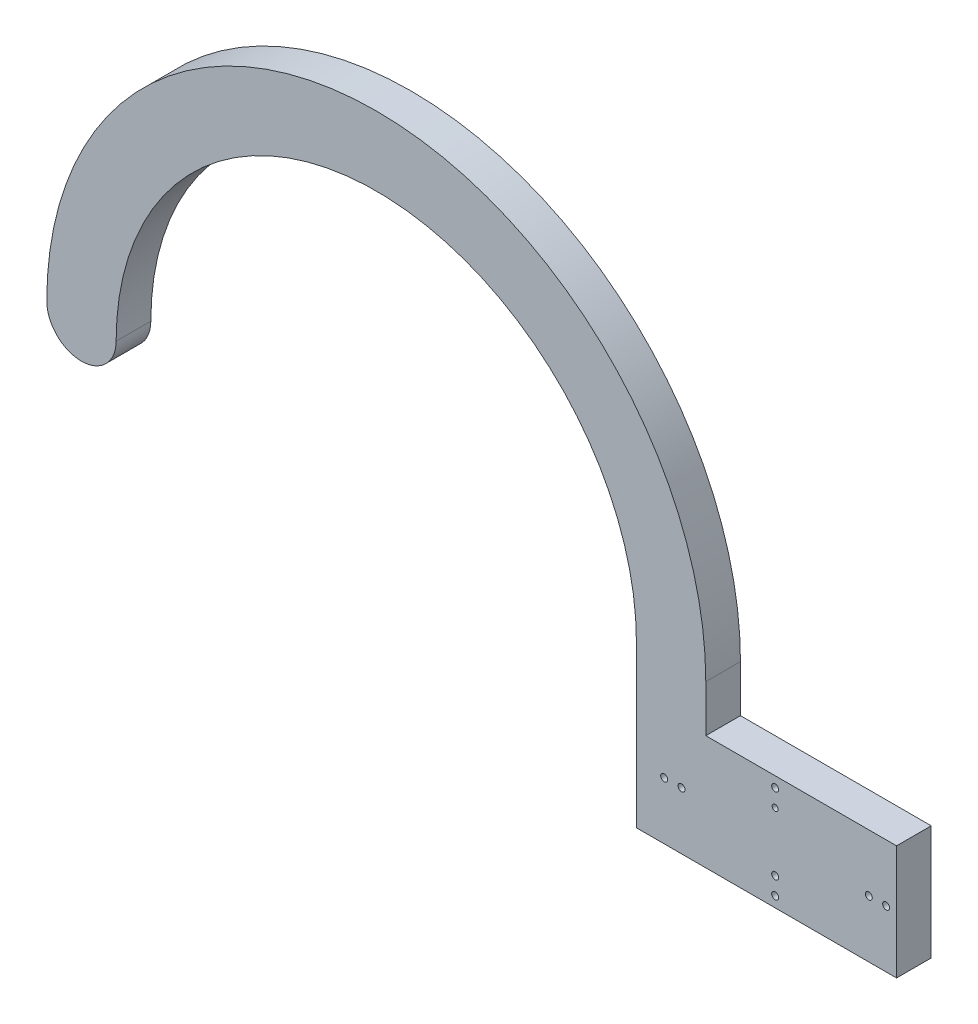
ISO-10303-21;
HEADER;
FILE_DESCRIPTION(('STEP AP214'),'2;1');
FILE_NAME('part.step','',(''),(''),'','','');
FILE_SCHEMA(('AUTOMOTIVE_DESIGN { 1 0 10303 214 1 1 1 1 }'));
ENDSEC;
DATA;
#1=APPLICATION_CONTEXT('core data for automotive mechanical design processes');
#2=APPLICATION_PROTOCOL_DEFINITION('international standard','automotive_design',2000,#1);
#3=PRODUCT_CONTEXT('',#1,'mechanical');
#4=PRODUCT('Part','Part','',(#3));
#5=PRODUCT_RELATED_PRODUCT_CATEGORY('part','',(#4));
#6=PRODUCT_DEFINITION_FORMATION('','',#4);
#7=PRODUCT_DEFINITION_CONTEXT('part definition',#1,'design');
#8=PRODUCT_DEFINITION('design','',#6,#7);
#9=PRODUCT_DEFINITION_SHAPE('','',#8);
#10=(LENGTH_UNIT() NAMED_UNIT(*) SI_UNIT(.MILLI.,.METRE.));
#11=(NAMED_UNIT(*) PLANE_ANGLE_UNIT() SI_UNIT($,.RADIAN.));
#12=(NAMED_UNIT(*) SI_UNIT($,.STERADIAN.) SOLID_ANGLE_UNIT());
#13=UNCERTAINTY_MEASURE_WITH_UNIT(LENGTH_MEASURE(1.E-05),#10,'distance_accuracy_value','');
#14=(GEOMETRIC_REPRESENTATION_CONTEXT(3) GLOBAL_UNCERTAINTY_ASSIGNED_CONTEXT((#13)) GLOBAL_UNIT_ASSIGNED_CONTEXT((#10,
#11,#12)) REPRESENTATION_CONTEXT('',''));
#15=CARTESIAN_POINT('',(0.,0.,0.));
#16=DIRECTION('',(0.,0.,1.));
#17=DIRECTION('',(1.,0.,0.));
#18=AXIS2_PLACEMENT_3D('',#15,#16,#17);
#19=CARTESIAN_POINT('',(37.5,9.80681495363282E-13,5.));
#20=DIRECTION('',(0.,0.,-1.));
#21=DIRECTION('',(-1.,0.,0.));
#22=AXIS2_PLACEMENT_3D('',#19,#20,#21);
#23=CYLINDRICAL_SURFACE('',#22,37.5);
#24=CARTESIAN_POINT('',(37.5,9.80681495363282E-13,0.));
#25=DIRECTION('',(0.,0.,1.));
#26=DIRECTION('',(1.,0.,0.));
#27=AXIS2_PLACEMENT_3D('',#24,#25,#26);
#28=CIRCLE('',#27,37.5);
#29=CARTESIAN_POINT('',(0.,0.,0.));
#30=VERTEX_POINT('',#29);
#31=CARTESIAN_POINT('',(75.,9.80987654294656E-13,0.));
#32=VERTEX_POINT('',#31);
#33=EDGE_CURVE('E155',#30,#32,#28,.F.);
#34=ORIENTED_EDGE('',*,*,#33,.T.);
#35=DIRECTION('',(0.,0.,-1.));
#36=VECTOR('',#35,1.);
#37=CARTESIAN_POINT('',(75.,9.80987654294656E-13,5.));
#38=LINE('',#37,#36);
#39=CARTESIAN_POINT('',(75.,9.80987654294656E-13,5.));
#40=VERTEX_POINT('',#39);
#41=EDGE_CURVE('E11',#40,#32,#38,.T.);
#42=ORIENTED_EDGE('',*,*,#41,.F.);
#43=CARTESIAN_POINT('',(37.5,9.80681495363282E-13,5.));
#44=DIRECTION('',(0.,0.,1.));
#45=DIRECTION('',(1.,0.,0.));
#46=AXIS2_PLACEMENT_3D('',#43,#44,#45);
#47=CIRCLE('',#46,37.5);
#48=CARTESIAN_POINT('',(0.,0.,5.));
#49=VERTEX_POINT('',#48);
#50=EDGE_CURVE('E225',#49,#40,#47,.F.);
#51=ORIENTED_EDGE('',*,*,#50,.F.);
#52=DIRECTION('',(0.,0.,-1.));
#53=VECTOR('',#52,1.);
#54=CARTESIAN_POINT('',(0.,0.,5.));
#55=LINE('',#54,#53);
#56=EDGE_CURVE('E151',#49,#30,#55,.T.);
#57=ORIENTED_EDGE('',*,*,#56,.T.);
#58=EDGE_LOOP('',(#34,#42,#51,#57));
#59=FACE_BOUND('',#58,.T.);
#60=ADVANCED_FACE('F35',(#59),#23,.F.);
#61=CARTESIAN_POINT('',(75.,0.,5.));
#62=DIRECTION('',(1.,0.,0.));
#63=DIRECTION('',(0.,0.,-1.));
#64=AXIS2_PLACEMENT_3D('',#61,#62,#63);
#65=PLANE('',#64);
#66=DIRECTION('',(0.,-1.,0.));
#67=VECTOR('',#66,1.);
#68=CARTESIAN_POINT('',(75.,0.,0.));
#69=LINE('',#68,#67);
#70=CARTESIAN_POINT('',(75.,-23.2499999999994,0.));
#71=VERTEX_POINT('',#70);
#72=EDGE_CURVE('E158',#32,#71,#69,.T.);
#73=ORIENTED_EDGE('',*,*,#72,.T.);
#74=DIRECTION('',(0.,0.,-1.));
#75=VECTOR('',#74,1.);
#76=CARTESIAN_POINT('',(75.,-23.2499999999994,5.));
#77=LINE('',#76,#75);
#78=CARTESIAN_POINT('',(75.,-23.2499999999994,5.));
#79=VERTEX_POINT('',#78);
#80=EDGE_CURVE('E44',#79,#71,#77,.T.);
#81=ORIENTED_EDGE('',*,*,#80,.F.);
#82=DIRECTION('',(0.,-1.,0.));
#83=VECTOR('',#82,1.);
#84=CARTESIAN_POINT('',(75.,0.,5.));
#85=LINE('',#84,#83);
#86=EDGE_CURVE('E91',#40,#79,#85,.T.);
#87=ORIENTED_EDGE('',*,*,#86,.F.);
#88=ORIENTED_EDGE('',*,*,#41,.T.);
#89=EDGE_LOOP('',(#73,#81,#87,#88));
#90=FACE_BOUND('',#89,.T.);
#91=ADVANCED_FACE('F244',(#90),#65,.F.);
#92=CARTESIAN_POINT('',(0.,-23.2499999999993,5.));
#93=DIRECTION('',(0.,1.,0.));
#94=DIRECTION('',(-1.,0.,0.));
#95=AXIS2_PLACEMENT_3D('',#92,#93,#94);
#96=PLANE('',#95);
#97=DIRECTION('',(1.,0.,0.));
#98=VECTOR('',#97,1.);
#99=CARTESIAN_POINT('',(0.,-23.2499999999993,0.));
#100=LINE('',#99,#98);
#101=CARTESIAN_POINT('',(112.50018609535,-23.2499999999994,0.));
#102=VERTEX_POINT('',#101);
#103=EDGE_CURVE('E160',#71,#102,#100,.T.);
#104=ORIENTED_EDGE('',*,*,#103,.T.);
#105=DIRECTION('',(0.,0.,-1.));
#106=VECTOR('',#105,1.);
#107=CARTESIAN_POINT('',(112.50018609535,-23.2499999999994,5.));
#108=LINE('',#107,#106);
#109=CARTESIAN_POINT('',(112.50018609535,-23.2499999999994,5.));
#110=VERTEX_POINT('',#109);
#111=EDGE_CURVE('E199',#110,#102,#108,.T.);
#112=ORIENTED_EDGE('',*,*,#111,.F.);
#113=DIRECTION('',(1.,0.,0.));
#114=VECTOR('',#113,1.);
#115=CARTESIAN_POINT('',(0.,-23.2499999999993,5.));
#116=LINE('',#115,#114);
#117=EDGE_CURVE('E207',#79,#110,#116,.T.);
#118=ORIENTED_EDGE('',*,*,#117,.F.);
#119=ORIENTED_EDGE('',*,*,#80,.T.);
#120=EDGE_LOOP('',(#104,#112,#118,#119));
#121=FACE_BOUND('',#120,.T.);
#122=ADVANCED_FACE('F205',(#121),#96,.F.);
#123=CARTESIAN_POINT('',(112.50018609535,0.,5.));
#124=DIRECTION('',(-1.,0.,0.));
#125=DIRECTION('',(0.,0.,1.));
#126=AXIS2_PLACEMENT_3D('',#123,#124,#125);
#127=PLANE('',#126);
#128=DIRECTION('',(0.,1.,0.));
#129=VECTOR('',#128,1.);
#130=CARTESIAN_POINT('',(112.50018609535,0.,0.));
#131=LINE('',#130,#129);
#132=CARTESIAN_POINT('',(112.50018609535,-6.74999999999938,0.));
#133=VERTEX_POINT('',#132);
#134=EDGE_CURVE('E162',#102,#133,#131,.T.);
#135=ORIENTED_EDGE('',*,*,#134,.T.);
#136=DIRECTION('',(0.,0.,-1.));
#137=VECTOR('',#136,1.);
#138=CARTESIAN_POINT('',(112.50018609535,-6.74999999999938,5.));
#139=LINE('',#138,#137);
#140=CARTESIAN_POINT('',(112.50018609535,-6.74999999999938,5.));
#141=VERTEX_POINT('',#140);
#142=EDGE_CURVE('E196',#141,#133,#139,.T.);
#143=ORIENTED_EDGE('',*,*,#142,.F.);
#144=DIRECTION('',(0.,1.,0.));
#145=VECTOR('',#144,1.);
#146=CARTESIAN_POINT('',(112.50018609535,0.,5.));
#147=LINE('',#146,#145);
#148=EDGE_CURVE('E220',#110,#141,#147,.T.);
#149=ORIENTED_EDGE('',*,*,#148,.F.);
#150=ORIENTED_EDGE('',*,*,#111,.T.);
#151=EDGE_LOOP('',(#135,#143,#149,#150));
#152=FACE_BOUND('',#151,.T.);
#153=ADVANCED_FACE('F216',(#152),#127,.F.);
#154=CARTESIAN_POINT('',(0.,-6.74999999999939,5.));
#155=DIRECTION('',(0.,-1.,0.));
#156=DIRECTION('',(1.,0.,0.));
#157=AXIS2_PLACEMENT_3D('',#154,#155,#156);
#158=PLANE('',#157);
#159=DIRECTION('',(-1.,0.,0.));
#160=VECTOR('',#159,1.);
#161=CARTESIAN_POINT('',(0.,-6.74999999999939,0.));
#162=LINE('',#161,#160);
#163=CARTESIAN_POINT('',(85.,-6.74999999999938,0.));
#164=VERTEX_POINT('',#163);
#165=EDGE_CURVE('E164',#133,#164,#162,.T.);
#166=ORIENTED_EDGE('',*,*,#165,.T.);
#167=DIRECTION('',(0.,0.,-1.));
#168=VECTOR('',#167,1.);
#169=CARTESIAN_POINT('',(85.,-6.74999999999938,5.));
#170=LINE('',#169,#168);
#171=CARTESIAN_POINT('',(85.,-6.74999999999938,5.));
#172=VERTEX_POINT('',#171);
#173=EDGE_CURVE('E116',#172,#164,#170,.T.);
#174=ORIENTED_EDGE('',*,*,#173,.F.);
#175=DIRECTION('',(-1.,0.,0.));
#176=VECTOR('',#175,1.);
#177=CARTESIAN_POINT('',(0.,-6.74999999999939,5.));
#178=LINE('',#177,#176);
#179=EDGE_CURVE('E122',#141,#172,#178,.T.);
#180=ORIENTED_EDGE('',*,*,#179,.F.);
#181=ORIENTED_EDGE('',*,*,#142,.T.);
#182=EDGE_LOOP('',(#166,#174,#180,#181));
#183=FACE_BOUND('',#182,.T.);
#184=ADVANCED_FACE('F219',(#183),#158,.F.);
#185=CARTESIAN_POINT('',(85.,0.,5.));
#186=DIRECTION('',(1.,0.,0.));
#187=DIRECTION('',(0.,0.,-1.));
#188=AXIS2_PLACEMENT_3D('',#185,#186,#187);
#189=PLANE('',#188);
#190=DIRECTION('',(0.,-1.,0.));
#191=VECTOR('',#190,1.);
#192=CARTESIAN_POINT('',(85.,0.,0.));
#193=LINE('',#192,#191);
#194=CARTESIAN_POINT('',(85.,6.8668567957679E-13,0.));
#195=VERTEX_POINT('',#194);
#196=EDGE_CURVE('E111',#195,#164,#193,.T.);
#197=ORIENTED_EDGE('',*,*,#196,.F.);
#198=DIRECTION('',(0.,0.,-1.));
#199=VECTOR('',#198,1.);
#200=CARTESIAN_POINT('',(85.,6.8668567957679E-13,5.));
#201=LINE('',#200,#199);
#202=CARTESIAN_POINT('',(85.,6.8668567957679E-13,5.));
#203=VERTEX_POINT('',#202);
#204=EDGE_CURVE('E106',#203,#195,#201,.T.);
#205=ORIENTED_EDGE('',*,*,#204,.F.);
#206=DIRECTION('',(0.,-1.,0.));
#207=VECTOR('',#206,1.);
#208=CARTESIAN_POINT('',(85.,0.,5.));
#209=LINE('',#208,#207);
#210=EDGE_CURVE('E109',#203,#172,#209,.T.);
#211=ORIENTED_EDGE('',*,*,#210,.T.);
#212=ORIENTED_EDGE('',*,*,#173,.T.);
#213=EDGE_LOOP('',(#197,#205,#211,#212));
#214=FACE_BOUND('',#213,.T.);
#215=ADVANCED_FACE('F108',(#214),#189,.T.);
#216=CARTESIAN_POINT('',(37.5,0.,5.));
#217=DIRECTION('',(0.,0.,-1.));
#218=DIRECTION('',(-1.,0.,0.));
#219=AXIS2_PLACEMENT_3D('',#216,#217,#218);
#220=CYLINDRICAL_SURFACE('',#219,47.5);
#221=CARTESIAN_POINT('',(37.5,0.,0.));
#222=DIRECTION('',(0.,0.,1.));
#223=DIRECTION('',(1.,0.,0.));
#224=AXIS2_PLACEMENT_3D('',#221,#222,#223);
#225=CIRCLE('',#224,47.5);
#226=CARTESIAN_POINT('',(-10.,-1.39453308442576E-13,0.));
#227=VERTEX_POINT('',#226);
#228=EDGE_CURVE('E168',#227,#195,#225,.F.);
#229=ORIENTED_EDGE('',*,*,#228,.F.);
#230=DIRECTION('',(0.,0.,-1.));
#231=VECTOR('',#230,1.);
#232=CARTESIAN_POINT('',(-10.,-1.39453308442576E-13,5.));
#233=LINE('',#232,#231);
#234=CARTESIAN_POINT('',(-10.,-1.39453308442576E-13,5.));
#235=VERTEX_POINT('',#234);
#236=EDGE_CURVE('E80',#235,#227,#233,.T.);
#237=ORIENTED_EDGE('',*,*,#236,.F.);
#238=CARTESIAN_POINT('',(37.5,0.,5.));
#239=DIRECTION('',(0.,0.,1.));
#240=DIRECTION('',(1.,0.,0.));
#241=AXIS2_PLACEMENT_3D('',#238,#239,#240);
#242=CIRCLE('',#241,47.5);
#243=EDGE_CURVE('E120',#235,#203,#242,.F.);
#244=ORIENTED_EDGE('',*,*,#243,.T.);
#245=ORIENTED_EDGE('',*,*,#204,.T.);
#246=EDGE_LOOP('',(#229,#237,#244,#245));
#247=FACE_BOUND('',#246,.T.);
#248=ADVANCED_FACE('F125',(#247),#220,.T.);
#249=CARTESIAN_POINT('',(95.,-10.7499999999994,5.));
#250=DIRECTION('',(0.,0.,-1.));
#251=DIRECTION('',(-1.,0.,0.));
#252=AXIS2_PLACEMENT_3D('',#249,#250,#251);
#253=CYLINDRICAL_SURFACE('',#252,0.429709328929351);
#254=CARTESIAN_POINT('',(95.,-10.7499999999994,5.));
#255=DIRECTION('',(0.,0.,1.));
#256=DIRECTION('',(1.,0.,0.));
#257=AXIS2_PLACEMENT_3D('',#254,#255,#256);
#258=CIRCLE('',#257,0.429709328929351);
#259=CARTESIAN_POINT('',(95.4297093289294,-10.7499999999994,5.));
#260=VERTEX_POINT('',#259);
#261=EDGE_CURVE('E145',#260,#260,#258,.T.);
#262=ORIENTED_EDGE('',*,*,#261,.T.);
#263=EDGE_LOOP('',(#262));
#264=FACE_BOUND('',#263,.T.);
#265=CARTESIAN_POINT('',(95.,-10.7499999999994,0.));
#266=DIRECTION('',(0.,0.,1.));
#267=DIRECTION('',(1.,0.,0.));
#268=AXIS2_PLACEMENT_3D('',#265,#266,#267);
#269=CIRCLE('',#268,0.429709328929351);
#270=CARTESIAN_POINT('',(95.4297093289294,-10.7499999999994,0.));
#271=VERTEX_POINT('',#270);
#272=EDGE_CURVE('E186',#271,#271,#269,.T.);
#273=ORIENTED_EDGE('',*,*,#272,.F.);
#274=EDGE_LOOP('',(#273));
#275=FACE_BOUND('',#274,.T.);
#276=ADVANCED_FACE('F261',(#264,#275),#253,.F.);
#277=CARTESIAN_POINT('',(95.,-19.2299999999994,5.));
#278=DIRECTION('',(0.,0.,-1.));
#279=DIRECTION('',(-1.,0.,0.));
#280=AXIS2_PLACEMENT_3D('',#277,#278,#279);
#281=CYLINDRICAL_SURFACE('',#280,0.499999999999999);
#282=CARTESIAN_POINT('',(95.,-19.2299999999994,5.));
#283=DIRECTION('',(0.,0.,1.));
#284=DIRECTION('',(1.,0.,0.));
#285=AXIS2_PLACEMENT_3D('',#282,#283,#284);
#286=CIRCLE('',#285,0.499999999999999);
#287=CARTESIAN_POINT('',(95.5,-19.2299999999994,5.));
#288=VERTEX_POINT('',#287);
#289=EDGE_CURVE('E142',#288,#288,#286,.T.);
#290=ORIENTED_EDGE('',*,*,#289,.T.);
#291=EDGE_LOOP('',(#290));
#292=FACE_BOUND('',#291,.T.);
#293=CARTESIAN_POINT('',(95.,-19.2299999999994,0.));
#294=DIRECTION('',(0.,0.,1.));
#295=DIRECTION('',(1.,0.,0.));
#296=AXIS2_PLACEMENT_3D('',#293,#294,#295);
#297=CIRCLE('',#296,0.499999999999999);
#298=CARTESIAN_POINT('',(95.5,-19.2299999999994,0.));
#299=VERTEX_POINT('',#298);
#300=EDGE_CURVE('E183',#299,#299,#297,.T.);
#301=ORIENTED_EDGE('',*,*,#300,.F.);
#302=EDGE_LOOP('',(#301));
#303=FACE_BOUND('',#302,.T.);
#304=ADVANCED_FACE('F280',(#292,#303),#281,.F.);
#305=CARTESIAN_POINT('',(108.50018609535,-14.9999999999994,5.));
#306=DIRECTION('',(0.,0.,-1.));
#307=DIRECTION('',(-1.,0.,0.));
#308=AXIS2_PLACEMENT_3D('',#305,#306,#307);
#309=CYLINDRICAL_SURFACE('',#308,0.499999999999999);
#310=CARTESIAN_POINT('',(108.50018609535,-14.9999999999994,5.));
#311=DIRECTION('',(0.,0.,1.));
#312=DIRECTION('',(1.,0.,0.));
#313=AXIS2_PLACEMENT_3D('',#310,#311,#312);
#314=CIRCLE('',#313,0.499999999999999);
#315=CARTESIAN_POINT('',(109.00018609535,-14.9999999999994,5.));
#316=VERTEX_POINT('',#315);
#317=EDGE_CURVE('E139',#316,#316,#314,.T.);
#318=ORIENTED_EDGE('',*,*,#317,.T.);
#319=EDGE_LOOP('',(#318));
#320=FACE_BOUND('',#319,.T.);
#321=CARTESIAN_POINT('',(108.50018609535,-14.9999999999994,0.));
#322=DIRECTION('',(0.,0.,1.));
#323=DIRECTION('',(1.,0.,0.));
#324=AXIS2_PLACEMENT_3D('',#321,#322,#323);
#325=CIRCLE('',#324,0.499999999999999);
#326=CARTESIAN_POINT('',(109.00018609535,-14.9999999999994,0.));
#327=VERTEX_POINT('',#326);
#328=EDGE_CURVE('E180',#327,#327,#325,.T.);
#329=ORIENTED_EDGE('',*,*,#328,.F.);
#330=EDGE_LOOP('',(#329));
#331=FACE_BOUND('',#330,.T.);
#332=ADVANCED_FACE('F276',(#320,#331),#309,.F.);
#333=CARTESIAN_POINT('',(111.00018609535,-14.9999999999994,5.));
#334=DIRECTION('',(0.,0.,-1.));
#335=DIRECTION('',(-1.,0.,0.));
#336=AXIS2_PLACEMENT_3D('',#333,#334,#335);
#337=CYLINDRICAL_SURFACE('',#336,0.499999999999999);
#338=CARTESIAN_POINT('',(111.00018609535,-14.9999999999994,5.));
#339=DIRECTION('',(0.,0.,1.));
#340=DIRECTION('',(1.,0.,0.));
#341=AXIS2_PLACEMENT_3D('',#338,#339,#340);
#342=CIRCLE('',#341,0.499999999999999);
#343=CARTESIAN_POINT('',(111.50018609535,-14.9999999999994,5.));
#344=VERTEX_POINT('',#343);
#345=EDGE_CURVE('E136',#344,#344,#342,.T.);
#346=ORIENTED_EDGE('',*,*,#345,.T.);
#347=EDGE_LOOP('',(#346));
#348=FACE_BOUND('',#347,.T.);
#349=CARTESIAN_POINT('',(111.00018609535,-14.9999999999994,0.));
#350=DIRECTION('',(0.,0.,1.));
#351=DIRECTION('',(1.,0.,0.));
#352=AXIS2_PLACEMENT_3D('',#349,#350,#351);
#353=CIRCLE('',#352,0.499999999999999);
#354=CARTESIAN_POINT('',(111.50018609535,-14.9999999999994,0.));
#355=VERTEX_POINT('',#354);
#356=EDGE_CURVE('E177',#355,#355,#353,.T.);
#357=ORIENTED_EDGE('',*,*,#356,.F.);
#358=EDGE_LOOP('',(#357));
#359=FACE_BOUND('',#358,.T.);
#360=ADVANCED_FACE('F272',(#348,#359),#337,.F.);
#361=CARTESIAN_POINT('',(95.,-21.7299999999994,5.));
#362=DIRECTION('',(0.,0.,-1.));
#363=DIRECTION('',(-1.,0.,0.));
#364=AXIS2_PLACEMENT_3D('',#361,#362,#363);
#365=CYLINDRICAL_SURFACE('',#364,0.499999999999999);
#366=CARTESIAN_POINT('',(95.,-21.7299999999994,5.));
#367=DIRECTION('',(0.,0.,1.));
#368=DIRECTION('',(1.,0.,0.));
#369=AXIS2_PLACEMENT_3D('',#366,#367,#368);
#370=CIRCLE('',#369,0.499999999999999);
#371=CARTESIAN_POINT('',(95.5,-21.7299999999994,5.));
#372=VERTEX_POINT('',#371);
#373=EDGE_CURVE('E133',#372,#372,#370,.T.);
#374=ORIENTED_EDGE('',*,*,#373,.T.);
#375=EDGE_LOOP('',(#374));
#376=FACE_BOUND('',#375,.T.);
#377=CARTESIAN_POINT('',(95.,-21.7299999999994,0.));
#378=DIRECTION('',(0.,0.,1.));
#379=DIRECTION('',(1.,0.,0.));
#380=AXIS2_PLACEMENT_3D('',#377,#378,#379);
#381=CIRCLE('',#380,0.499999999999999);
#382=CARTESIAN_POINT('',(95.5,-21.7299999999994,0.));
#383=VERTEX_POINT('',#382);
#384=EDGE_CURVE('E174',#383,#383,#381,.T.);
#385=ORIENTED_EDGE('',*,*,#384,.F.);
#386=EDGE_LOOP('',(#385));
#387=FACE_BOUND('',#386,.T.);
#388=ADVANCED_FACE('F268',(#376,#387),#365,.F.);
#389=CARTESIAN_POINT('',(81.5001860953498,-14.9999999999994,5.));
#390=DIRECTION('',(0.,0.,-1.));
#391=DIRECTION('',(-1.,0.,0.));
#392=AXIS2_PLACEMENT_3D('',#389,#390,#391);
#393=CYLINDRICAL_SURFACE('',#392,0.499999999999999);
#394=CARTESIAN_POINT('',(81.5001860953498,-14.9999999999994,5.));
#395=DIRECTION('',(0.,0.,1.));
#396=DIRECTION('',(1.,0.,0.));
#397=AXIS2_PLACEMENT_3D('',#394,#395,#396);
#398=CIRCLE('',#397,0.499999999999999);
#399=CARTESIAN_POINT('',(82.0001860953498,-14.9999999999994,5.));
#400=VERTEX_POINT('',#399);
#401=EDGE_CURVE('E127',#400,#400,#398,.T.);
#402=ORIENTED_EDGE('',*,*,#401,.T.);
#403=EDGE_LOOP('',(#402));
#404=FACE_BOUND('',#403,.T.);
#405=CARTESIAN_POINT('',(81.5001860953498,-14.9999999999994,0.));
#406=DIRECTION('',(0.,0.,1.));
#407=DIRECTION('',(1.,0.,0.));
#408=AXIS2_PLACEMENT_3D('',#405,#406,#407);
#409=CIRCLE('',#408,0.499999999999999);
#410=CARTESIAN_POINT('',(82.0001860953498,-14.9999999999994,0.));
#411=VERTEX_POINT('',#410);
#412=EDGE_CURVE('E171',#411,#411,#409,.T.);
#413=ORIENTED_EDGE('',*,*,#412,.F.);
#414=EDGE_LOOP('',(#413));
#415=FACE_BOUND('',#414,.T.);
#416=ADVANCED_FACE('F265',(#404,#415),#393,.F.);
#417=CARTESIAN_POINT('',(-5.,0.,5.));
#418=DIRECTION('',(0.,0.,-1.));
#419=DIRECTION('',(-1.,0.,0.));
#420=AXIS2_PLACEMENT_3D('',#417,#418,#419);
#421=CYLINDRICAL_SURFACE('',#420,5.);
#422=CARTESIAN_POINT('',(-5.,0.,0.));
#423=DIRECTION('',(0.,0.,1.));
#424=DIRECTION('',(1.,0.,0.));
#425=AXIS2_PLACEMENT_3D('',#422,#423,#424);
#426=CIRCLE('',#425,5.);
#427=EDGE_CURVE('E83',#227,#30,#426,.T.);
#428=ORIENTED_EDGE('',*,*,#427,.T.);
#429=ORIENTED_EDGE('',*,*,#56,.F.);
#430=CARTESIAN_POINT('',(-5.,0.,5.));
#431=DIRECTION('',(0.,0.,1.));
#432=DIRECTION('',(1.,0.,0.));
#433=AXIS2_PLACEMENT_3D('',#430,#431,#432);
#434=CIRCLE('',#433,5.);
#435=EDGE_CURVE('E52',#235,#49,#434,.T.);
#436=ORIENTED_EDGE('',*,*,#435,.F.);
#437=ORIENTED_EDGE('',*,*,#236,.T.);
#438=EDGE_LOOP('',(#428,#429,#436,#437));
#439=FACE_BOUND('',#438,.T.);
#440=ADVANCED_FACE('F262',(#439),#421,.T.);
#441=CARTESIAN_POINT('',(79.0001860953498,-14.9999999999994,5.));
#442=DIRECTION('',(0.,0.,-1.));
#443=DIRECTION('',(-1.,0.,0.));
#444=AXIS2_PLACEMENT_3D('',#441,#442,#443);
#445=CYLINDRICAL_SURFACE('',#444,0.499999999999999);
#446=CARTESIAN_POINT('',(79.0001860953498,-14.9999999999994,5.));
#447=DIRECTION('',(0.,0.,1.));
#448=DIRECTION('',(1.,0.,0.));
#449=AXIS2_PLACEMENT_3D('',#446,#447,#448);
#450=CIRCLE('',#449,0.499999999999999);
#451=CARTESIAN_POINT('',(79.5001860953498,-14.9999999999994,5.));
#452=VERTEX_POINT('',#451);
#453=EDGE_CURVE('E192',#452,#452,#450,.T.);
#454=ORIENTED_EDGE('',*,*,#453,.T.);
#455=EDGE_LOOP('',(#454));
#456=FACE_BOUND('',#455,.T.);
#457=CARTESIAN_POINT('',(79.0001860953498,-14.9999999999994,0.));
#458=DIRECTION('',(0.,0.,1.));
#459=DIRECTION('',(1.,0.,0.));
#460=AXIS2_PLACEMENT_3D('',#457,#458,#459);
#461=CIRCLE('',#460,0.499999999999999);
#462=CARTESIAN_POINT('',(79.5001860953498,-14.9999999999994,0.));
#463=VERTEX_POINT('',#462);
#464=EDGE_CURVE('E152',#463,#463,#461,.T.);
#465=ORIENTED_EDGE('',*,*,#464,.F.);
#466=EDGE_LOOP('',(#465));
#467=FACE_BOUND('',#466,.T.);
#468=ADVANCED_FACE('F37',(#456,#467),#445,.F.);
#469=CARTESIAN_POINT('',(95.,-8.24999999999938,5.));
#470=DIRECTION('',(0.,0.,-1.));
#471=DIRECTION('',(-1.,0.,0.));
#472=AXIS2_PLACEMENT_3D('',#469,#470,#471);
#473=CYLINDRICAL_SURFACE('',#472,0.49999999999997);
#474=CARTESIAN_POINT('',(95.,-8.24999999999938,5.));
#475=DIRECTION('',(0.,0.,1.));
#476=DIRECTION('',(1.,0.,0.));
#477=AXIS2_PLACEMENT_3D('',#474,#475,#476);
#478=CIRCLE('',#477,0.49999999999997);
#479=CARTESIAN_POINT('',(95.5,-8.24999999999938,5.));
#480=VERTEX_POINT('',#479);
#481=EDGE_CURVE('E148',#480,#480,#478,.T.);
#482=ORIENTED_EDGE('',*,*,#481,.T.);
#483=EDGE_LOOP('',(#482));
#484=FACE_BOUND('',#483,.T.);
#485=CARTESIAN_POINT('',(95.,-8.24999999999938,0.));
#486=DIRECTION('',(0.,0.,1.));
#487=DIRECTION('',(1.,0.,0.));
#488=AXIS2_PLACEMENT_3D('',#485,#486,#487);
#489=CIRCLE('',#488,0.49999999999997);
#490=CARTESIAN_POINT('',(95.5,-8.24999999999938,0.));
#491=VERTEX_POINT('',#490);
#492=EDGE_CURVE('E189',#491,#491,#489,.T.);
#493=ORIENTED_EDGE('',*,*,#492,.F.);
#494=EDGE_LOOP('',(#493));
#495=FACE_BOUND('',#494,.T.);
#496=ADVANCED_FACE('F233',(#484,#495),#473,.F.);
#497=CARTESIAN_POINT('',(0.,0.,5.));
#498=DIRECTION('',(0.,0.,1.));
#499=DIRECTION('',(1.,0.,0.));
#500=AXIS2_PLACEMENT_3D('',#497,#498,#499);
#501=PLANE('',#500);
#502=ORIENTED_EDGE('',*,*,#453,.F.);
#503=EDGE_LOOP('',(#502));
#504=FACE_BOUND('',#503,.T.);
#505=ORIENTED_EDGE('',*,*,#50,.T.);
#506=ORIENTED_EDGE('',*,*,#86,.T.);
#507=ORIENTED_EDGE('',*,*,#117,.T.);
#508=ORIENTED_EDGE('',*,*,#148,.T.);
#509=ORIENTED_EDGE('',*,*,#179,.T.);
#510=ORIENTED_EDGE('',*,*,#210,.F.);
#511=ORIENTED_EDGE('',*,*,#243,.F.);
#512=ORIENTED_EDGE('',*,*,#435,.T.);
#513=EDGE_LOOP('',(#505,#506,#507,#508,#509,#510,#511,#512));
#514=FACE_BOUND('',#513,.T.);
#515=ORIENTED_EDGE('',*,*,#401,.F.);
#516=EDGE_LOOP('',(#515));
#517=FACE_BOUND('',#516,.T.);
#518=ORIENTED_EDGE('',*,*,#373,.F.);
#519=EDGE_LOOP('',(#518));
#520=FACE_BOUND('',#519,.T.);
#521=ORIENTED_EDGE('',*,*,#345,.F.);
#522=EDGE_LOOP('',(#521));
#523=FACE_BOUND('',#522,.T.);
#524=ORIENTED_EDGE('',*,*,#317,.F.);
#525=EDGE_LOOP('',(#524));
#526=FACE_BOUND('',#525,.T.);
#527=ORIENTED_EDGE('',*,*,#289,.F.);
#528=EDGE_LOOP('',(#527));
#529=FACE_BOUND('',#528,.T.);
#530=ORIENTED_EDGE('',*,*,#261,.F.);
#531=EDGE_LOOP('',(#530));
#532=FACE_BOUND('',#531,.T.);
#533=ORIENTED_EDGE('',*,*,#481,.F.);
#534=EDGE_LOOP('',(#533));
#535=FACE_BOUND('',#534,.T.);
#536=ADVANCED_FACE('F118',(#504,#514,#517,#520,#523,#526,#529,#532,#535),#501,.T.);
#537=CARTESIAN_POINT('',(0.,0.,0.));
#538=DIRECTION('',(0.,0.,1.));
#539=DIRECTION('',(1.,0.,0.));
#540=AXIS2_PLACEMENT_3D('',#537,#538,#539);
#541=PLANE('',#540);
#542=ORIENTED_EDGE('',*,*,#464,.T.);
#543=EDGE_LOOP('',(#542));
#544=FACE_BOUND('',#543,.T.);
#545=ORIENTED_EDGE('',*,*,#33,.F.);
#546=ORIENTED_EDGE('',*,*,#427,.F.);
#547=ORIENTED_EDGE('',*,*,#228,.T.);
#548=ORIENTED_EDGE('',*,*,#196,.T.);
#549=ORIENTED_EDGE('',*,*,#165,.F.);
#550=ORIENTED_EDGE('',*,*,#134,.F.);
#551=ORIENTED_EDGE('',*,*,#103,.F.);
#552=ORIENTED_EDGE('',*,*,#72,.F.);
#553=EDGE_LOOP('',(#545,#546,#547,#548,#549,#550,#551,#552));
#554=FACE_BOUND('',#553,.T.);
#555=ORIENTED_EDGE('',*,*,#412,.T.);
#556=EDGE_LOOP('',(#555));
#557=FACE_BOUND('',#556,.T.);
#558=ORIENTED_EDGE('',*,*,#384,.T.);
#559=EDGE_LOOP('',(#558));
#560=FACE_BOUND('',#559,.T.);
#561=ORIENTED_EDGE('',*,*,#356,.T.);
#562=EDGE_LOOP('',(#561));
#563=FACE_BOUND('',#562,.T.);
#564=ORIENTED_EDGE('',*,*,#328,.T.);
#565=EDGE_LOOP('',(#564));
#566=FACE_BOUND('',#565,.T.);
#567=ORIENTED_EDGE('',*,*,#300,.T.);
#568=EDGE_LOOP('',(#567));
#569=FACE_BOUND('',#568,.T.);
#570=ORIENTED_EDGE('',*,*,#272,.T.);
#571=EDGE_LOOP('',(#570));
#572=FACE_BOUND('',#571,.T.);
#573=ORIENTED_EDGE('',*,*,#492,.T.);
#574=EDGE_LOOP('',(#573));
#575=FACE_BOUND('',#574,.T.);
#576=ADVANCED_FACE('F211',(#544,#554,#557,#560,#563,#566,#569,#572,#575),#541,.F.);
#577=CLOSED_SHELL('',(#60,#91,#122,#153,#184,#215,#248,#276,#304,#332,#360,#388,#416,#440,#468,
#496,#536,#576));
#578=MANIFOLD_SOLID_BREP('B2',#577);
#579=ADVANCED_BREP_SHAPE_REPRESENTATION('',(#18,#578),#14);
#580=SHAPE_DEFINITION_REPRESENTATION(#9,#579);
ENDSEC;
END-ISO-10303-21;
